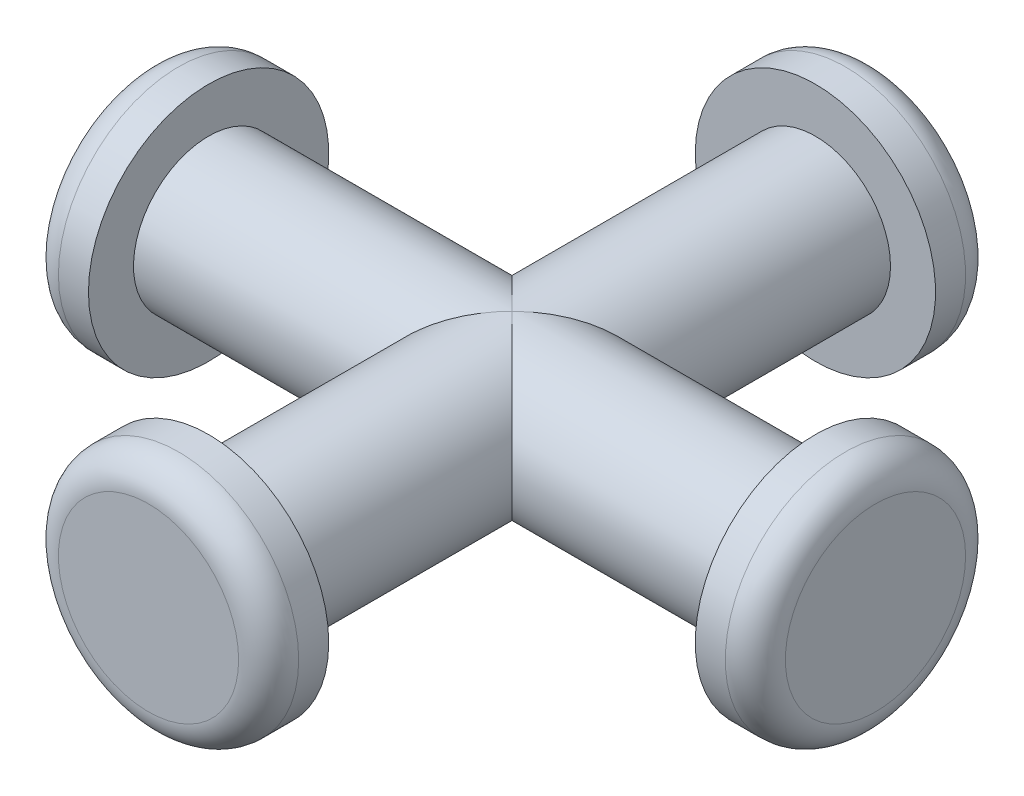
ISO-10303-21;
HEADER;
FILE_DESCRIPTION(('STEP AP214'),'2;1');
FILE_NAME('part.step','',(''),(''),'','','');
FILE_SCHEMA(('AUTOMOTIVE_DESIGN { 1 0 10303 214 1 1 1 1 }'));
ENDSEC;
DATA;
#1=APPLICATION_CONTEXT('core data for automotive mechanical design processes');
#2=APPLICATION_PROTOCOL_DEFINITION('international standard','automotive_design',2000,#1);
#3=PRODUCT_CONTEXT('',#1,'mechanical');
#4=PRODUCT('Part','Part','',(#3));
#5=PRODUCT_RELATED_PRODUCT_CATEGORY('part','',(#4));
#6=PRODUCT_DEFINITION_FORMATION('','',#4);
#7=PRODUCT_DEFINITION_CONTEXT('part definition',#1,'design');
#8=PRODUCT_DEFINITION('design','',#6,#7);
#9=PRODUCT_DEFINITION_SHAPE('','',#8);
#10=(LENGTH_UNIT() NAMED_UNIT(*) SI_UNIT(.MILLI.,.METRE.));
#11=(NAMED_UNIT(*) PLANE_ANGLE_UNIT() SI_UNIT($,.RADIAN.));
#12=(NAMED_UNIT(*) SI_UNIT($,.STERADIAN.) SOLID_ANGLE_UNIT());
#13=UNCERTAINTY_MEASURE_WITH_UNIT(LENGTH_MEASURE(1.E-05),#10,'distance_accuracy_value','');
#14=(GEOMETRIC_REPRESENTATION_CONTEXT(3) GLOBAL_UNCERTAINTY_ASSIGNED_CONTEXT((#13)) GLOBAL_UNIT_ASSIGNED_CONTEXT((#10,
#11,#12)) REPRESENTATION_CONTEXT('',''));
#15=CARTESIAN_POINT('',(0.,0.,0.));
#16=DIRECTION('',(0.,0.,1.));
#17=DIRECTION('',(1.,0.,0.));
#18=AXIS2_PLACEMENT_3D('',#15,#16,#17);
#19=CARTESIAN_POINT('',(0.,0.,10.1));
#20=DIRECTION('',(0.,0.,-1.));
#21=DIRECTION('',(-1.,0.,0.));
#22=AXIS2_PLACEMENT_3D('',#19,#20,#21);
#23=CYLINDRICAL_SURFACE('',#22,2.5);
#24=CARTESIAN_POINT('',(0.,0.,10.1));
#25=DIRECTION('',(0.,0.,1.));
#26=DIRECTION('',(1.,0.,0.));
#27=AXIS2_PLACEMENT_3D('',#24,#25,#26);
#28=CIRCLE('',#27,2.5);
#29=CARTESIAN_POINT('',(2.5,0.,10.1));
#30=VERTEX_POINT('',#29);
#31=EDGE_CURVE('E62',#30,#30,#28,.T.);
#32=ORIENTED_EDGE('',*,*,#31,.F.);
#33=EDGE_LOOP('',(#32));
#34=FACE_BOUND('',#33,.T.);
#35=CARTESIAN_POINT('',(0.,0.,0.));
#36=DIRECTION('',(-0.707106781186547,0.,-0.707106781186547));
#37=DIRECTION('',(0.707106781186547,0.,-0.707106781186547));
#38=AXIS2_PLACEMENT_3D('',#35,#36,#37);
#39=ELLIPSE('',#38,3.53553390593274,2.5);
#40=CARTESIAN_POINT('',(0.,-2.5,0.));
#41=VERTEX_POINT('',#40);
#42=CARTESIAN_POINT('',(0.,2.5,0.));
#43=VERTEX_POINT('',#42);
#44=EDGE_CURVE('E55',#41,#43,#39,.T.);
#45=ORIENTED_EDGE('',*,*,#44,.F.);
#46=CARTESIAN_POINT('',(0.,0.,0.));
#47=DIRECTION('',(0.707106781186547,0.,-0.707106781186547));
#48=DIRECTION('',(-0.707106781186547,0.,-0.707106781186547));
#49=AXIS2_PLACEMENT_3D('',#46,#47,#48);
#50=ELLIPSE('',#49,3.53553390593274,2.5);
#51=EDGE_CURVE('E54',#43,#41,#50,.T.);
#52=ORIENTED_EDGE('',*,*,#51,.F.);
#53=EDGE_LOOP('',(#45,#52));
#54=FACE_BOUND('',#53,.T.);
#55=ADVANCED_FACE('F34',(#34,#54),#23,.T.);
#56=CARTESIAN_POINT('',(10.1,0.,0.));
#57=DIRECTION('',(-1.,0.,0.));
#58=DIRECTION('',(0.,0.,1.));
#59=AXIS2_PLACEMENT_3D('',#56,#57,#58);
#60=CYLINDRICAL_SURFACE('',#59,2.5);
#61=CARTESIAN_POINT('',(-10.1,0.,0.));
#62=DIRECTION('',(1.,0.,0.));
#63=DIRECTION('',(0.,0.,-1.));
#64=AXIS2_PLACEMENT_3D('',#61,#62,#63);
#65=CIRCLE('',#64,2.5);
#66=CARTESIAN_POINT('',(-10.1,0.,-2.5));
#67=VERTEX_POINT('',#66);
#68=EDGE_CURVE('E133',#67,#67,#65,.T.);
#69=ORIENTED_EDGE('',*,*,#68,.T.);
#70=EDGE_LOOP('',(#69));
#71=FACE_BOUND('',#70,.T.);
#72=CARTESIAN_POINT('',(0.,0.,0.));
#73=DIRECTION('',(0.707106781186547,0.,-0.707106781186547));
#74=DIRECTION('',(-0.707106781186547,0.,-0.707106781186547));
#75=AXIS2_PLACEMENT_3D('',#72,#73,#74);
#76=ELLIPSE('',#75,3.53553390593274,2.5);
#77=EDGE_CURVE('E48',#43,#41,#76,.F.);
#78=ORIENTED_EDGE('',*,*,#77,.T.);
#79=ORIENTED_EDGE('',*,*,#44,.T.);
#80=EDGE_LOOP('',(#78,#79));
#81=FACE_BOUND('',#80,.T.);
#82=ADVANCED_FACE('F64',(#71,#81),#60,.T.);
#83=CARTESIAN_POINT('',(0.,0.,-10.1));
#84=DIRECTION('',(0.,0.,1.));
#85=DIRECTION('',(1.,0.,0.));
#86=AXIS2_PLACEMENT_3D('',#83,#84,#85);
#87=CIRCLE('',#86,2.5);
#88=CARTESIAN_POINT('',(2.5,0.,-10.1));
#89=VERTEX_POINT('',#88);
#90=EDGE_CURVE('E119',#89,#89,#87,.T.);
#91=ORIENTED_EDGE('',*,*,#90,.T.);
#92=EDGE_LOOP('',(#91));
#93=FACE_BOUND('',#92,.T.);
#94=CARTESIAN_POINT('',(0.,0.,0.));
#95=DIRECTION('',(-0.707106781186547,0.,-0.707106781186547));
#96=DIRECTION('',(0.707106781186547,0.,-0.707106781186547));
#97=AXIS2_PLACEMENT_3D('',#94,#95,#96);
#98=ELLIPSE('',#97,3.53553390593274,2.5);
#99=EDGE_CURVE('E61',#41,#43,#98,.F.);
#100=ORIENTED_EDGE('',*,*,#99,.F.);
#101=ORIENTED_EDGE('',*,*,#77,.F.);
#102=EDGE_LOOP('',(#100,#101));
#103=FACE_BOUND('',#102,.T.);
#104=ADVANCED_FACE('F60',(#93,#103),#23,.T.);
#105=CARTESIAN_POINT('',(10.1,0.,0.));
#106=DIRECTION('',(1.,0.,0.));
#107=DIRECTION('',(0.,0.,-1.));
#108=AXIS2_PLACEMENT_3D('',#105,#106,#107);
#109=CIRCLE('',#108,2.5);
#110=CARTESIAN_POINT('',(10.1,0.,-2.5));
#111=VERTEX_POINT('',#110);
#112=EDGE_CURVE('E132',#111,#111,#109,.T.);
#113=ORIENTED_EDGE('',*,*,#112,.F.);
#114=EDGE_LOOP('',(#113));
#115=FACE_BOUND('',#114,.T.);
#116=ORIENTED_EDGE('',*,*,#51,.T.);
#117=ORIENTED_EDGE('',*,*,#99,.T.);
#118=EDGE_LOOP('',(#116,#117));
#119=FACE_BOUND('',#118,.T.);
#120=ADVANCED_FACE('F66',(#115,#119),#60,.T.);
#121=CARTESIAN_POINT('',(12.1,0.,0.));
#122=DIRECTION('',(-1.,0.,0.));
#123=DIRECTION('',(0.,0.,1.));
#124=AXIS2_PLACEMENT_3D('',#121,#122,#123);
#125=CYLINDRICAL_SURFACE('',#124,4.);
#126=CARTESIAN_POINT('',(11.1,0.,0.));
#127=DIRECTION('',(1.,0.,0.));
#128=DIRECTION('',(0.,0.,-1.));
#129=AXIS2_PLACEMENT_3D('',#126,#127,#128);
#130=CIRCLE('',#129,4.);
#131=CARTESIAN_POINT('',(11.1,0.,-4.));
#132=VERTEX_POINT('',#131);
#133=EDGE_CURVE('E84',#132,#132,#130,.F.);
#134=ORIENTED_EDGE('',*,*,#133,.T.);
#135=EDGE_LOOP('',(#134));
#136=FACE_BOUND('',#135,.T.);
#137=CARTESIAN_POINT('',(10.1,0.,0.));
#138=DIRECTION('',(1.,0.,0.));
#139=DIRECTION('',(0.,0.,-1.));
#140=AXIS2_PLACEMENT_3D('',#137,#138,#139);
#141=CIRCLE('',#140,4.);
#142=CARTESIAN_POINT('',(10.1,0.,-4.));
#143=VERTEX_POINT('',#142);
#144=EDGE_CURVE('E136',#143,#143,#141,.T.);
#145=ORIENTED_EDGE('',*,*,#144,.T.);
#146=EDGE_LOOP('',(#145));
#147=FACE_BOUND('',#146,.T.);
#148=ADVANCED_FACE('F115',(#136,#147),#125,.T.);
#149=CARTESIAN_POINT('',(12.1,0.,0.));
#150=DIRECTION('',(1.,0.,0.));
#151=DIRECTION('',(0.,0.,-1.));
#152=AXIS2_PLACEMENT_3D('',#149,#150,#151);
#153=PLANE('',#152);
#154=CARTESIAN_POINT('',(12.1,0.,0.));
#155=DIRECTION('',(1.,0.,0.));
#156=DIRECTION('',(0.,0.,-1.));
#157=AXIS2_PLACEMENT_3D('',#154,#155,#156);
#158=CIRCLE('',#157,3.);
#159=CARTESIAN_POINT('',(12.1,0.,-3.));
#160=VERTEX_POINT('',#159);
#161=EDGE_CURVE('E81',#160,#160,#158,.T.);
#162=ORIENTED_EDGE('',*,*,#161,.T.);
#163=EDGE_LOOP('',(#162));
#164=FACE_BOUND('',#163,.T.);
#165=ADVANCED_FACE('F166',(#164),#153,.T.);
#166=CARTESIAN_POINT('',(10.1,0.,0.));
#167=DIRECTION('',(1.,0.,0.));
#168=DIRECTION('',(0.,0.,-1.));
#169=AXIS2_PLACEMENT_3D('',#166,#167,#168);
#170=PLANE('',#169);
#171=ORIENTED_EDGE('',*,*,#112,.T.);
#172=EDGE_LOOP('',(#171));
#173=FACE_BOUND('',#172,.T.);
#174=ORIENTED_EDGE('',*,*,#144,.F.);
#175=EDGE_LOOP('',(#174));
#176=FACE_BOUND('',#175,.T.);
#177=ADVANCED_FACE('F164',(#173,#176),#170,.F.);
#178=CARTESIAN_POINT('',(-12.1,0.,0.));
#179=DIRECTION('',(1.,0.,0.));
#180=DIRECTION('',(0.,0.,-1.));
#181=AXIS2_PLACEMENT_3D('',#178,#179,#180);
#182=CYLINDRICAL_SURFACE('',#181,4.);
#183=CARTESIAN_POINT('',(-11.1,0.,0.));
#184=DIRECTION('',(-1.,0.,0.));
#185=DIRECTION('',(0.,0.,1.));
#186=AXIS2_PLACEMENT_3D('',#183,#184,#185);
#187=CIRCLE('',#186,4.);
#188=CARTESIAN_POINT('',(-11.1,0.,4.));
#189=VERTEX_POINT('',#188);
#190=EDGE_CURVE('E70',#189,#189,#187,.F.);
#191=ORIENTED_EDGE('',*,*,#190,.T.);
#192=EDGE_LOOP('',(#191));
#193=FACE_BOUND('',#192,.T.);
#194=CARTESIAN_POINT('',(-10.1,0.,0.));
#195=DIRECTION('',(-1.,0.,0.));
#196=DIRECTION('',(0.,0.,1.));
#197=AXIS2_PLACEMENT_3D('',#194,#195,#196);
#198=CIRCLE('',#197,4.);
#199=CARTESIAN_POINT('',(-10.1,0.,4.));
#200=VERTEX_POINT('',#199);
#201=EDGE_CURVE('E125',#200,#200,#198,.T.);
#202=ORIENTED_EDGE('',*,*,#201,.T.);
#203=EDGE_LOOP('',(#202));
#204=FACE_BOUND('',#203,.T.);
#205=ADVANCED_FACE('F144',(#193,#204),#182,.T.);
#206=CARTESIAN_POINT('',(-12.1,0.,0.));
#207=DIRECTION('',(-1.,0.,0.));
#208=DIRECTION('',(0.,0.,1.));
#209=AXIS2_PLACEMENT_3D('',#206,#207,#208);
#210=PLANE('',#209);
#211=CARTESIAN_POINT('',(-12.1,0.,0.));
#212=DIRECTION('',(-1.,0.,0.));
#213=DIRECTION('',(0.,0.,1.));
#214=AXIS2_PLACEMENT_3D('',#211,#212,#213);
#215=CIRCLE('',#214,3.);
#216=CARTESIAN_POINT('',(-12.1,0.,3.));
#217=VERTEX_POINT('',#216);
#218=EDGE_CURVE('E67',#217,#217,#215,.T.);
#219=ORIENTED_EDGE('',*,*,#218,.T.);
#220=EDGE_LOOP('',(#219));
#221=FACE_BOUND('',#220,.T.);
#222=ADVANCED_FACE('F149',(#221),#210,.T.);
#223=CARTESIAN_POINT('',(-10.1,0.,0.));
#224=DIRECTION('',(-1.,0.,0.));
#225=DIRECTION('',(0.,0.,1.));
#226=AXIS2_PLACEMENT_3D('',#223,#224,#225);
#227=PLANE('',#226);
#228=ORIENTED_EDGE('',*,*,#68,.F.);
#229=EDGE_LOOP('',(#228));
#230=FACE_BOUND('',#229,.T.);
#231=ORIENTED_EDGE('',*,*,#201,.F.);
#232=EDGE_LOOP('',(#231));
#233=FACE_BOUND('',#232,.T.);
#234=ADVANCED_FACE('F146',(#230,#233),#227,.F.);
#235=CARTESIAN_POINT('',(0.,0.,12.1));
#236=DIRECTION('',(0.,0.,-1.));
#237=DIRECTION('',(-1.,0.,0.));
#238=AXIS2_PLACEMENT_3D('',#235,#236,#237);
#239=CYLINDRICAL_SURFACE('',#238,4.);
#240=CARTESIAN_POINT('',(0.,0.,11.1));
#241=DIRECTION('',(0.,0.,1.));
#242=DIRECTION('',(1.,0.,0.));
#243=AXIS2_PLACEMENT_3D('',#240,#241,#242);
#244=CIRCLE('',#243,4.);
#245=CARTESIAN_POINT('',(4.,0.,11.1));
#246=VERTEX_POINT('',#245);
#247=EDGE_CURVE('E11',#246,#246,#244,.F.);
#248=ORIENTED_EDGE('',*,*,#247,.T.);
#249=EDGE_LOOP('',(#248));
#250=FACE_BOUND('',#249,.T.);
#251=CARTESIAN_POINT('',(0.,0.,10.1));
#252=DIRECTION('',(0.,0.,1.));
#253=DIRECTION('',(1.,0.,0.));
#254=AXIS2_PLACEMENT_3D('',#251,#252,#253);
#255=CIRCLE('',#254,4.);
#256=CARTESIAN_POINT('',(4.,0.,10.1));
#257=VERTEX_POINT('',#256);
#258=EDGE_CURVE('E121',#257,#257,#255,.T.);
#259=ORIENTED_EDGE('',*,*,#258,.T.);
#260=EDGE_LOOP('',(#259));
#261=FACE_BOUND('',#260,.T.);
#262=ADVANCED_FACE('F148',(#250,#261),#239,.T.);
#263=CARTESIAN_POINT('',(0.,0.,12.1));
#264=DIRECTION('',(0.,0.,1.));
#265=DIRECTION('',(1.,0.,0.));
#266=AXIS2_PLACEMENT_3D('',#263,#264,#265);
#267=PLANE('',#266);
#268=CARTESIAN_POINT('',(0.,0.,12.1));
#269=DIRECTION('',(0.,0.,1.));
#270=DIRECTION('',(1.,0.,0.));
#271=AXIS2_PLACEMENT_3D('',#268,#269,#270);
#272=CIRCLE('',#271,3.);
#273=CARTESIAN_POINT('',(3.,0.,12.1));
#274=VERTEX_POINT('',#273);
#275=EDGE_CURVE('E42',#274,#274,#272,.T.);
#276=ORIENTED_EDGE('',*,*,#275,.T.);
#277=EDGE_LOOP('',(#276));
#278=FACE_BOUND('',#277,.T.);
#279=ADVANCED_FACE('F89',(#278),#267,.T.);
#280=CARTESIAN_POINT('',(0.,0.,10.1));
#281=DIRECTION('',(0.,0.,1.));
#282=DIRECTION('',(1.,0.,0.));
#283=AXIS2_PLACEMENT_3D('',#280,#281,#282);
#284=PLANE('',#283);
#285=ORIENTED_EDGE('',*,*,#31,.T.);
#286=EDGE_LOOP('',(#285));
#287=FACE_BOUND('',#286,.T.);
#288=ORIENTED_EDGE('',*,*,#258,.F.);
#289=EDGE_LOOP('',(#288));
#290=FACE_BOUND('',#289,.T.);
#291=ADVANCED_FACE('F218',(#287,#290),#284,.F.);
#292=CARTESIAN_POINT('',(0.,0.,-12.1));
#293=DIRECTION('',(0.,0.,1.));
#294=DIRECTION('',(1.,0.,0.));
#295=AXIS2_PLACEMENT_3D('',#292,#293,#294);
#296=CYLINDRICAL_SURFACE('',#295,4.);
#297=CARTESIAN_POINT('',(0.,0.,-11.1));
#298=DIRECTION('',(0.,0.,-1.));
#299=DIRECTION('',(-1.,0.,0.));
#300=AXIS2_PLACEMENT_3D('',#297,#298,#299);
#301=CIRCLE('',#300,4.);
#302=CARTESIAN_POINT('',(-4.,0.,-11.1));
#303=VERTEX_POINT('',#302);
#304=EDGE_CURVE('E78',#303,#303,#301,.F.);
#305=ORIENTED_EDGE('',*,*,#304,.T.);
#306=EDGE_LOOP('',(#305));
#307=FACE_BOUND('',#306,.T.);
#308=CARTESIAN_POINT('',(0.,0.,-10.1));
#309=DIRECTION('',(0.,0.,-1.));
#310=DIRECTION('',(-1.,0.,0.));
#311=AXIS2_PLACEMENT_3D('',#308,#309,#310);
#312=CIRCLE('',#311,4.);
#313=CARTESIAN_POINT('',(-4.,0.,-10.1));
#314=VERTEX_POINT('',#313);
#315=EDGE_CURVE('E122',#314,#314,#312,.T.);
#316=ORIENTED_EDGE('',*,*,#315,.T.);
#317=EDGE_LOOP('',(#316));
#318=FACE_BOUND('',#317,.T.);
#319=ADVANCED_FACE('F225',(#307,#318),#296,.T.);
#320=CARTESIAN_POINT('',(0.,0.,-12.1));
#321=DIRECTION('',(0.,0.,-1.));
#322=DIRECTION('',(-1.,0.,0.));
#323=AXIS2_PLACEMENT_3D('',#320,#321,#322);
#324=PLANE('',#323);
#325=CARTESIAN_POINT('',(0.,0.,-12.1));
#326=DIRECTION('',(0.,0.,-1.));
#327=DIRECTION('',(-1.,0.,0.));
#328=AXIS2_PLACEMENT_3D('',#325,#326,#327);
#329=CIRCLE('',#328,3.);
#330=CARTESIAN_POINT('',(-3.,0.,-12.1));
#331=VERTEX_POINT('',#330);
#332=EDGE_CURVE('E75',#331,#331,#329,.T.);
#333=ORIENTED_EDGE('',*,*,#332,.T.);
#334=EDGE_LOOP('',(#333));
#335=FACE_BOUND('',#334,.T.);
#336=ADVANCED_FACE('F230',(#335),#324,.T.);
#337=CARTESIAN_POINT('',(0.,0.,-10.1));
#338=DIRECTION('',(0.,0.,-1.));
#339=DIRECTION('',(-1.,0.,0.));
#340=AXIS2_PLACEMENT_3D('',#337,#338,#339);
#341=PLANE('',#340);
#342=ORIENTED_EDGE('',*,*,#90,.F.);
#343=EDGE_LOOP('',(#342));
#344=FACE_BOUND('',#343,.T.);
#345=ORIENTED_EDGE('',*,*,#315,.F.);
#346=EDGE_LOOP('',(#345));
#347=FACE_BOUND('',#346,.T.);
#348=ADVANCED_FACE('F240',(#344,#347),#341,.F.);
#349=CARTESIAN_POINT('',(-11.1,0.,0.));
#350=DIRECTION('',(-1.,0.,0.));
#351=DIRECTION('',(0.,0.,1.));
#352=AXIS2_PLACEMENT_3D('',#349,#350,#351);
#353=TOROIDAL_SURFACE('',#352,3.,1.);
#354=ORIENTED_EDGE('',*,*,#190,.F.);
#355=EDGE_LOOP('',(#354));
#356=FACE_BOUND('',#355,.T.);
#357=ORIENTED_EDGE('',*,*,#218,.F.);
#358=EDGE_LOOP('',(#357));
#359=FACE_BOUND('',#358,.T.);
#360=ADVANCED_FACE('F248',(#356,#359),#353,.T.);
#361=CARTESIAN_POINT('',(0.,0.,-11.1));
#362=DIRECTION('',(0.,0.,-1.));
#363=DIRECTION('',(-1.,0.,0.));
#364=AXIS2_PLACEMENT_3D('',#361,#362,#363);
#365=TOROIDAL_SURFACE('',#364,3.,1.);
#366=ORIENTED_EDGE('',*,*,#304,.F.);
#367=EDGE_LOOP('',(#366));
#368=FACE_BOUND('',#367,.T.);
#369=ORIENTED_EDGE('',*,*,#332,.F.);
#370=EDGE_LOOP('',(#369));
#371=FACE_BOUND('',#370,.T.);
#372=ADVANCED_FACE('F97',(#368,#371),#365,.T.);
#373=CARTESIAN_POINT('',(11.1,0.,0.));
#374=DIRECTION('',(1.,0.,0.));
#375=DIRECTION('',(0.,0.,-1.));
#376=AXIS2_PLACEMENT_3D('',#373,#374,#375);
#377=TOROIDAL_SURFACE('',#376,3.,1.);
#378=ORIENTED_EDGE('',*,*,#133,.F.);
#379=EDGE_LOOP('',(#378));
#380=FACE_BOUND('',#379,.T.);
#381=ORIENTED_EDGE('',*,*,#161,.F.);
#382=EDGE_LOOP('',(#381));
#383=FACE_BOUND('',#382,.T.);
#384=ADVANCED_FACE('F92',(#380,#383),#377,.T.);
#385=CARTESIAN_POINT('',(0.,0.,11.1));
#386=DIRECTION('',(0.,0.,1.));
#387=DIRECTION('',(1.,0.,0.));
#388=AXIS2_PLACEMENT_3D('',#385,#386,#387);
#389=TOROIDAL_SURFACE('',#388,3.,1.);
#390=ORIENTED_EDGE('',*,*,#247,.F.);
#391=EDGE_LOOP('',(#390));
#392=FACE_BOUND('',#391,.T.);
#393=ORIENTED_EDGE('',*,*,#275,.F.);
#394=EDGE_LOOP('',(#393));
#395=FACE_BOUND('',#394,.T.);
#396=ADVANCED_FACE('F36',(#392,#395),#389,.T.);
#397=CLOSED_SHELL('',(#55,#82,#104,#120,#148,#165,#177,#205,#222,#234,#262,#279,#291,#319,#336,
#348,#360,#372,#384,#396));
#398=MANIFOLD_SOLID_BREP('B2',#397);
#399=ADVANCED_BREP_SHAPE_REPRESENTATION('',(#18,#398),#14);
#400=SHAPE_DEFINITION_REPRESENTATION(#9,#399);
ENDSEC;
END-ISO-10303-21;
